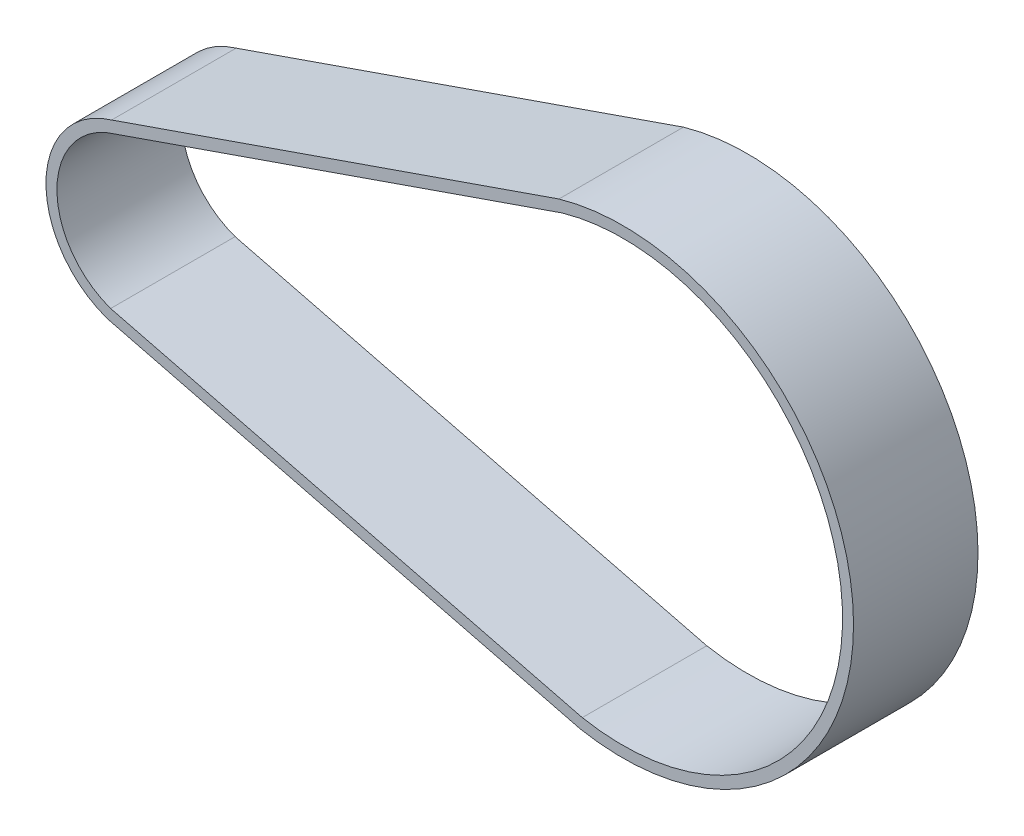
ISO-10303-21;
HEADER;
FILE_DESCRIPTION(('STEP AP214'),'2;1');
FILE_NAME('part.step','',(''),(''),'','','');
FILE_SCHEMA(('AUTOMOTIVE_DESIGN { 1 0 10303 214 1 1 1 1 }'));
ENDSEC;
DATA;
#1=APPLICATION_CONTEXT('core data for automotive mechanical design processes');
#2=APPLICATION_PROTOCOL_DEFINITION('international standard','automotive_design',2000,#1);
#3=PRODUCT_CONTEXT('',#1,'mechanical');
#4=PRODUCT('Part','Part','',(#3));
#5=PRODUCT_RELATED_PRODUCT_CATEGORY('part','',(#4));
#6=PRODUCT_DEFINITION_FORMATION('','',#4);
#7=PRODUCT_DEFINITION_CONTEXT('part definition',#1,'design');
#8=PRODUCT_DEFINITION('design','',#6,#7);
#9=PRODUCT_DEFINITION_SHAPE('','',#8);
#10=(LENGTH_UNIT() NAMED_UNIT(*) SI_UNIT(.MILLI.,.METRE.));
#11=(NAMED_UNIT(*) PLANE_ANGLE_UNIT() SI_UNIT($,.RADIAN.));
#12=(NAMED_UNIT(*) SI_UNIT($,.STERADIAN.) SOLID_ANGLE_UNIT());
#13=UNCERTAINTY_MEASURE_WITH_UNIT(LENGTH_MEASURE(1.E-05),#10,'distance_accuracy_value','');
#14=(GEOMETRIC_REPRESENTATION_CONTEXT(3) GLOBAL_UNCERTAINTY_ASSIGNED_CONTEXT((#13)) GLOBAL_UNIT_ASSIGNED_CONTEXT((#10,
#11,#12)) REPRESENTATION_CONTEXT('',''));
#15=CARTESIAN_POINT('',(0.,0.,0.));
#16=DIRECTION('',(0.,0.,1.));
#17=DIRECTION('',(1.,0.,0.));
#18=AXIS2_PLACEMENT_3D('',#15,#16,#17);
#19=CARTESIAN_POINT('',(0.,0.,17.));
#20=DIRECTION('',(0.,0.,1.));
#21=DIRECTION('',(1.,0.,0.));
#22=AXIS2_PLACEMENT_3D('',#19,#20,#21);
#23=PLANE('',#22);
#24=CARTESIAN_POINT('',(0.,0.,17.));
#25=DIRECTION('',(0.,0.,1.));
#26=DIRECTION('',(1.,0.,0.));
#27=AXIS2_PLACEMENT_3D('',#24,#25,#26);
#28=CIRCLE('',#27,12.5);
#29=CARTESIAN_POINT('',(-3.52715358110991,11.9920468484435,17.));
#30=VERTEX_POINT('',#29);
#31=CARTESIAN_POINT('',(-4.09366996734266,-11.8106674747229,17.));
#32=VERTEX_POINT('',#31);
#33=EDGE_CURVE('E153',#30,#32,#28,.T.);
#34=ORIENTED_EDGE('',*,*,#33,.T.);
#35=DIRECTION('',(0.969859681499123,-0.243664109385069,0.));
#36=VECTOR('',#35,1.);
#37=CARTESIAN_POINT('',(60.4275412443757,-28.0207479288855,17.));
#38=LINE('',#37,#36);
#39=CARTESIAN_POINT('',(60.4275412443757,-28.0207479288855,17.));
#40=VERTEX_POINT('',#39);
#41=EDGE_CURVE('E157',#32,#40,#38,.T.);
#42=ORIENTED_EDGE('',*,*,#41,.T.);
#43=CARTESIAN_POINT('',(66.2952267423918,2.92792355950595,17.));
#44=DIRECTION('',(0.,0.,1.));
#45=DIRECTION('',(1.,0.,0.));
#46=AXIS2_PLACEMENT_3D('',#43,#44,#45);
#47=CIRCLE('',#46,31.5);
#48=CARTESIAN_POINT('',(57.5631540870234,33.1934304467426,17.));
#49=VERTEX_POINT('',#48);
#50=EDGE_CURVE('E161',#40,#49,#47,.T.);
#51=ORIENTED_EDGE('',*,*,#50,.T.);
#52=DIRECTION('',(-0.944724105495002,-0.327866382077619,0.));
#53=VECTOR('',#52,1.);
#54=CARTESIAN_POINT('',(-3.52715358110991,11.9920468484435,17.));
#55=LINE('',#54,#53);
#56=EDGE_CURVE('E164',#49,#30,#55,.T.);
#57=ORIENTED_EDGE('',*,*,#56,.T.);
#58=EDGE_LOOP('',(#34,#42,#51,#57));
#59=FACE_BOUND('',#58,.T.);
#60=DIRECTION('',(0.969859681499124,-0.243664109385069,0.));
#61=VECTOR('',#60,1.);
#62=CARTESIAN_POINT('',(60.7497526996339,-26.5550837097856,17.));
#63=LINE('',#62,#61);
#64=CARTESIAN_POINT('',(-3.66244157731263,-10.3723922839802,17.));
#65=VERTEX_POINT('',#64);
#66=CARTESIAN_POINT('',(60.7497526996339,-26.5550837097856,17.));
#67=VERTEX_POINT('',#66);
#68=EDGE_CURVE('E114',#65,#67,#63,.T.);
#69=ORIENTED_EDGE('',*,*,#68,.F.);
#70=CARTESIAN_POINT('',(0.,0.,17.));
#71=DIRECTION('',(0.,0.,1.));
#72=DIRECTION('',(1.,0.,0.));
#73=AXIS2_PLACEMENT_3D('',#70,#71,#72);
#74=CIRCLE('',#73,11.);
#75=CARTESIAN_POINT('',(-3.07044819637986,10.5627812565322,17.));
#76=VERTEX_POINT('',#75);
#77=EDGE_CURVE('E105',#76,#65,#74,.T.);
#78=ORIENTED_EDGE('',*,*,#77,.F.);
#79=DIRECTION('',(-0.944724105495002,-0.327866382077619,0.));
#80=VECTOR('',#79,1.);
#81=CARTESIAN_POINT('',(-3.07044819637986,10.5627812565322,17.));
#82=LINE('',#81,#80);
#83=CARTESIAN_POINT('',(58.0168212644981,31.7631104453851,17.));
#84=VERTEX_POINT('',#83);
#85=EDGE_CURVE('E131',#84,#76,#82,.T.);
#86=ORIENTED_EDGE('',*,*,#85,.F.);
#87=CARTESIAN_POINT('',(66.2952267423918,2.92792355950595,17.));
#88=DIRECTION('',(0.,0.,1.));
#89=DIRECTION('',(1.,0.,0.));
#90=AXIS2_PLACEMENT_3D('',#87,#88,#89);
#91=CIRCLE('',#90,30.);
#92=EDGE_CURVE('E127',#67,#84,#91,.T.);
#93=ORIENTED_EDGE('',*,*,#92,.F.);
#94=EDGE_LOOP('',(#69,#78,#86,#93));
#95=FACE_BOUND('',#94,.T.);
#96=ADVANCED_FACE('F39',(#59,#95),#23,.T.);
#97=CARTESIAN_POINT('',(0.,0.,0.));
#98=DIRECTION('',(0.,0.,1.));
#99=DIRECTION('',(1.,0.,0.));
#100=AXIS2_PLACEMENT_3D('',#97,#98,#99);
#101=PLANE('',#100);
#102=CARTESIAN_POINT('',(0.,0.,0.));
#103=DIRECTION('',(0.,0.,1.));
#104=DIRECTION('',(1.,0.,0.));
#105=AXIS2_PLACEMENT_3D('',#102,#103,#104);
#106=CIRCLE('',#105,12.5);
#107=CARTESIAN_POINT('',(-3.52715358110991,11.9920468484435,0.));
#108=VERTEX_POINT('',#107);
#109=CARTESIAN_POINT('',(-4.09366996734266,-11.8106674747229,0.));
#110=VERTEX_POINT('',#109);
#111=EDGE_CURVE('E123',#108,#110,#106,.T.);
#112=ORIENTED_EDGE('',*,*,#111,.F.);
#113=DIRECTION('',(-0.944724105495002,-0.327866382077619,0.));
#114=VECTOR('',#113,1.);
#115=CARTESIAN_POINT('',(-3.52715358110991,11.9920468484435,0.));
#116=LINE('',#115,#114);
#117=CARTESIAN_POINT('',(57.5631540870234,33.1934304467426,0.));
#118=VERTEX_POINT('',#117);
#119=EDGE_CURVE('E158',#118,#108,#116,.T.);
#120=ORIENTED_EDGE('',*,*,#119,.F.);
#121=CARTESIAN_POINT('',(66.2952267423918,2.92792355950595,0.));
#122=DIRECTION('',(0.,0.,1.));
#123=DIRECTION('',(1.,0.,0.));
#124=AXIS2_PLACEMENT_3D('',#121,#122,#123);
#125=CIRCLE('',#124,31.5);
#126=CARTESIAN_POINT('',(60.4275412443757,-28.0207479288855,0.));
#127=VERTEX_POINT('',#126);
#128=EDGE_CURVE('E174',#127,#118,#125,.T.);
#129=ORIENTED_EDGE('',*,*,#128,.F.);
#130=DIRECTION('',(0.969859681499123,-0.243664109385069,0.));
#131=VECTOR('',#130,1.);
#132=CARTESIAN_POINT('',(60.4275412443757,-28.0207479288855,0.));
#133=LINE('',#132,#131);
#134=EDGE_CURVE('E171',#110,#127,#133,.T.);
#135=ORIENTED_EDGE('',*,*,#134,.F.);
#136=EDGE_LOOP('',(#112,#120,#129,#135));
#137=FACE_BOUND('',#136,.T.);
#138=CARTESIAN_POINT('',(0.,0.,0.));
#139=DIRECTION('',(0.,0.,1.));
#140=DIRECTION('',(1.,0.,0.));
#141=AXIS2_PLACEMENT_3D('',#138,#139,#140);
#142=CIRCLE('',#141,11.);
#143=CARTESIAN_POINT('',(-3.07044819637986,10.5627812565322,0.));
#144=VERTEX_POINT('',#143);
#145=CARTESIAN_POINT('',(-3.66244157731263,-10.3723922839802,0.));
#146=VERTEX_POINT('',#145);
#147=EDGE_CURVE('E63',#144,#146,#142,.T.);
#148=ORIENTED_EDGE('',*,*,#147,.T.);
#149=DIRECTION('',(0.969859681499124,-0.243664109385069,0.));
#150=VECTOR('',#149,1.);
#151=CARTESIAN_POINT('',(60.7497526996339,-26.5550837097856,0.));
#152=LINE('',#151,#150);
#153=CARTESIAN_POINT('',(60.7497526996339,-26.5550837097856,0.));
#154=VERTEX_POINT('',#153);
#155=EDGE_CURVE('E121',#146,#154,#152,.T.);
#156=ORIENTED_EDGE('',*,*,#155,.T.);
#157=CARTESIAN_POINT('',(66.2952267423918,2.92792355950595,0.));
#158=DIRECTION('',(0.,0.,1.));
#159=DIRECTION('',(1.,0.,0.));
#160=AXIS2_PLACEMENT_3D('',#157,#158,#159);
#161=CIRCLE('',#160,30.);
#162=CARTESIAN_POINT('',(58.0168212644981,31.7631104453851,0.));
#163=VERTEX_POINT('',#162);
#164=EDGE_CURVE('E140',#154,#163,#161,.T.);
#165=ORIENTED_EDGE('',*,*,#164,.T.);
#166=DIRECTION('',(-0.944724105495002,-0.327866382077619,0.));
#167=VECTOR('',#166,1.);
#168=CARTESIAN_POINT('',(-3.07044819637986,10.5627812565322,0.));
#169=LINE('',#168,#167);
#170=EDGE_CURVE('E115',#163,#144,#169,.T.);
#171=ORIENTED_EDGE('',*,*,#170,.T.);
#172=EDGE_LOOP('',(#148,#156,#165,#171));
#173=FACE_BOUND('',#172,.T.);
#174=ADVANCED_FACE('F197',(#137,#173),#101,.F.);
#175=CARTESIAN_POINT('',(0.,0.,17.));
#176=DIRECTION('',(0.,0.,-1.));
#177=DIRECTION('',(-1.,0.,0.));
#178=AXIS2_PLACEMENT_3D('',#175,#176,#177);
#179=CYLINDRICAL_SURFACE('',#178,12.5);
#180=ORIENTED_EDGE('',*,*,#111,.T.);
#181=DIRECTION('',(0.,0.,-1.));
#182=VECTOR('',#181,1.);
#183=CARTESIAN_POINT('',(-4.09366996734266,-11.8106674747229,17.));
#184=LINE('',#183,#182);
#185=EDGE_CURVE('E11',#32,#110,#184,.T.);
#186=ORIENTED_EDGE('',*,*,#185,.F.);
#187=ORIENTED_EDGE('',*,*,#33,.F.);
#188=DIRECTION('',(0.,0.,-1.));
#189=VECTOR('',#188,1.);
#190=CARTESIAN_POINT('',(-3.52715358110991,11.9920468484435,17.));
#191=LINE('',#190,#189);
#192=EDGE_CURVE('E167',#30,#108,#191,.T.);
#193=ORIENTED_EDGE('',*,*,#192,.T.);
#194=EDGE_LOOP('',(#180,#186,#187,#193));
#195=FACE_BOUND('',#194,.T.);
#196=ADVANCED_FACE('F41',(#195),#179,.T.);
#197=CARTESIAN_POINT('',(60.4275412443757,-28.0207479288855,17.));
#198=DIRECTION('',(0.243664109385069,0.969859681499123,0.));
#199=DIRECTION('',(-0.969859681499123,0.243664109385069,0.));
#200=AXIS2_PLACEMENT_3D('',#197,#198,#199);
#201=PLANE('',#200);
#202=ORIENTED_EDGE('',*,*,#134,.T.);
#203=DIRECTION('',(0.,0.,-1.));
#204=VECTOR('',#203,1.);
#205=CARTESIAN_POINT('',(60.4275412443757,-28.0207479288855,17.));
#206=LINE('',#205,#204);
#207=EDGE_CURVE('E48',#40,#127,#206,.T.);
#208=ORIENTED_EDGE('',*,*,#207,.F.);
#209=ORIENTED_EDGE('',*,*,#41,.F.);
#210=ORIENTED_EDGE('',*,*,#185,.T.);
#211=EDGE_LOOP('',(#202,#208,#209,#210));
#212=FACE_BOUND('',#211,.T.);
#213=ADVANCED_FACE('F207',(#212),#201,.F.);
#214=CARTESIAN_POINT('',(66.2952267423918,2.92792355950595,17.));
#215=DIRECTION('',(0.,0.,-1.));
#216=DIRECTION('',(-1.,0.,0.));
#217=AXIS2_PLACEMENT_3D('',#214,#215,#216);
#218=CYLINDRICAL_SURFACE('',#217,31.5);
#219=ORIENTED_EDGE('',*,*,#128,.T.);
#220=DIRECTION('',(0.,0.,-1.));
#221=VECTOR('',#220,1.);
#222=CARTESIAN_POINT('',(57.5631540870234,33.1934304467426,17.));
#223=LINE('',#222,#221);
#224=EDGE_CURVE('E182',#49,#118,#223,.T.);
#225=ORIENTED_EDGE('',*,*,#224,.F.);
#226=ORIENTED_EDGE('',*,*,#50,.F.);
#227=ORIENTED_EDGE('',*,*,#207,.T.);
#228=EDGE_LOOP('',(#219,#225,#226,#227));
#229=FACE_BOUND('',#228,.T.);
#230=ADVANCED_FACE('F191',(#229),#218,.T.);
#231=CARTESIAN_POINT('',(-3.52715358110991,11.9920468484435,17.));
#232=DIRECTION('',(0.327866382077619,-0.944724105495003,0.));
#233=DIRECTION('',(0.944724105495003,0.327866382077619,0.));
#234=AXIS2_PLACEMENT_3D('',#231,#232,#233);
#235=PLANE('',#234);
#236=ORIENTED_EDGE('',*,*,#119,.T.);
#237=ORIENTED_EDGE('',*,*,#192,.F.);
#238=ORIENTED_EDGE('',*,*,#56,.F.);
#239=ORIENTED_EDGE('',*,*,#224,.T.);
#240=EDGE_LOOP('',(#236,#237,#238,#239));
#241=FACE_BOUND('',#240,.T.);
#242=ADVANCED_FACE('F201',(#241),#235,.F.);
#243=CARTESIAN_POINT('',(0.,0.,17.));
#244=DIRECTION('',(0.,0.,-1.));
#245=DIRECTION('',(-1.,0.,0.));
#246=AXIS2_PLACEMENT_3D('',#243,#244,#245);
#247=CYLINDRICAL_SURFACE('',#246,11.);
#248=ORIENTED_EDGE('',*,*,#147,.F.);
#249=DIRECTION('',(0.,0.,-1.));
#250=VECTOR('',#249,1.);
#251=CARTESIAN_POINT('',(-3.07044819637986,10.5627812565322,17.));
#252=LINE('',#251,#250);
#253=EDGE_CURVE('E109',#76,#144,#252,.T.);
#254=ORIENTED_EDGE('',*,*,#253,.F.);
#255=ORIENTED_EDGE('',*,*,#77,.T.);
#256=DIRECTION('',(0.,0.,-1.));
#257=VECTOR('',#256,1.);
#258=CARTESIAN_POINT('',(-3.66244157731263,-10.3723922839802,17.));
#259=LINE('',#258,#257);
#260=EDGE_CURVE('E108',#65,#146,#259,.T.);
#261=ORIENTED_EDGE('',*,*,#260,.T.);
#262=EDGE_LOOP('',(#248,#254,#255,#261));
#263=FACE_BOUND('',#262,.T.);
#264=ADVANCED_FACE('F107',(#263),#247,.F.);
#265=CARTESIAN_POINT('',(60.7497526996339,-26.5550837097856,17.));
#266=DIRECTION('',(0.243664109385069,0.969859681499123,0.));
#267=DIRECTION('',(-0.969859681499123,0.243664109385069,0.));
#268=AXIS2_PLACEMENT_3D('',#265,#266,#267);
#269=PLANE('',#268);
#270=ORIENTED_EDGE('',*,*,#155,.F.);
#271=ORIENTED_EDGE('',*,*,#260,.F.);
#272=ORIENTED_EDGE('',*,*,#68,.T.);
#273=DIRECTION('',(0.,0.,-1.));
#274=VECTOR('',#273,1.);
#275=CARTESIAN_POINT('',(60.7497526996339,-26.5550837097856,17.));
#276=LINE('',#275,#274);
#277=EDGE_CURVE('E124',#67,#154,#276,.T.);
#278=ORIENTED_EDGE('',*,*,#277,.T.);
#279=EDGE_LOOP('',(#270,#271,#272,#278));
#280=FACE_BOUND('',#279,.T.);
#281=ADVANCED_FACE('F118',(#280),#269,.T.);
#282=CARTESIAN_POINT('',(66.2952267423918,2.92792355950595,17.));
#283=DIRECTION('',(0.,0.,-1.));
#284=DIRECTION('',(-1.,0.,0.));
#285=AXIS2_PLACEMENT_3D('',#282,#283,#284);
#286=CYLINDRICAL_SURFACE('',#285,30.);
#287=ORIENTED_EDGE('',*,*,#164,.F.);
#288=ORIENTED_EDGE('',*,*,#277,.F.);
#289=ORIENTED_EDGE('',*,*,#92,.T.);
#290=DIRECTION('',(0.,0.,-1.));
#291=VECTOR('',#290,1.);
#292=CARTESIAN_POINT('',(58.0168212644981,31.7631104453851,17.));
#293=LINE('',#292,#291);
#294=EDGE_CURVE('E55',#84,#163,#293,.T.);
#295=ORIENTED_EDGE('',*,*,#294,.T.);
#296=EDGE_LOOP('',(#287,#288,#289,#295));
#297=FACE_BOUND('',#296,.T.);
#298=ADVANCED_FACE('F230',(#297),#286,.F.);
#299=CARTESIAN_POINT('',(-3.07044819637986,10.5627812565322,17.));
#300=DIRECTION('',(0.327866382077619,-0.944724105495003,0.));
#301=DIRECTION('',(0.944724105495003,0.327866382077619,0.));
#302=AXIS2_PLACEMENT_3D('',#299,#300,#301);
#303=PLANE('',#302);
#304=ORIENTED_EDGE('',*,*,#170,.F.);
#305=ORIENTED_EDGE('',*,*,#294,.F.);
#306=ORIENTED_EDGE('',*,*,#85,.T.);
#307=ORIENTED_EDGE('',*,*,#253,.T.);
#308=EDGE_LOOP('',(#304,#305,#306,#307));
#309=FACE_BOUND('',#308,.T.);
#310=ADVANCED_FACE('F234',(#309),#303,.T.);
#311=CLOSED_SHELL('',(#96,#174,#196,#213,#230,#242,#264,#281,#298,#310));
#312=MANIFOLD_SOLID_BREP('B2',#311);
#313=ADVANCED_BREP_SHAPE_REPRESENTATION('',(#18,#312),#14);
#314=SHAPE_DEFINITION_REPRESENTATION(#9,#313);
ENDSEC;
END-ISO-10303-21;
